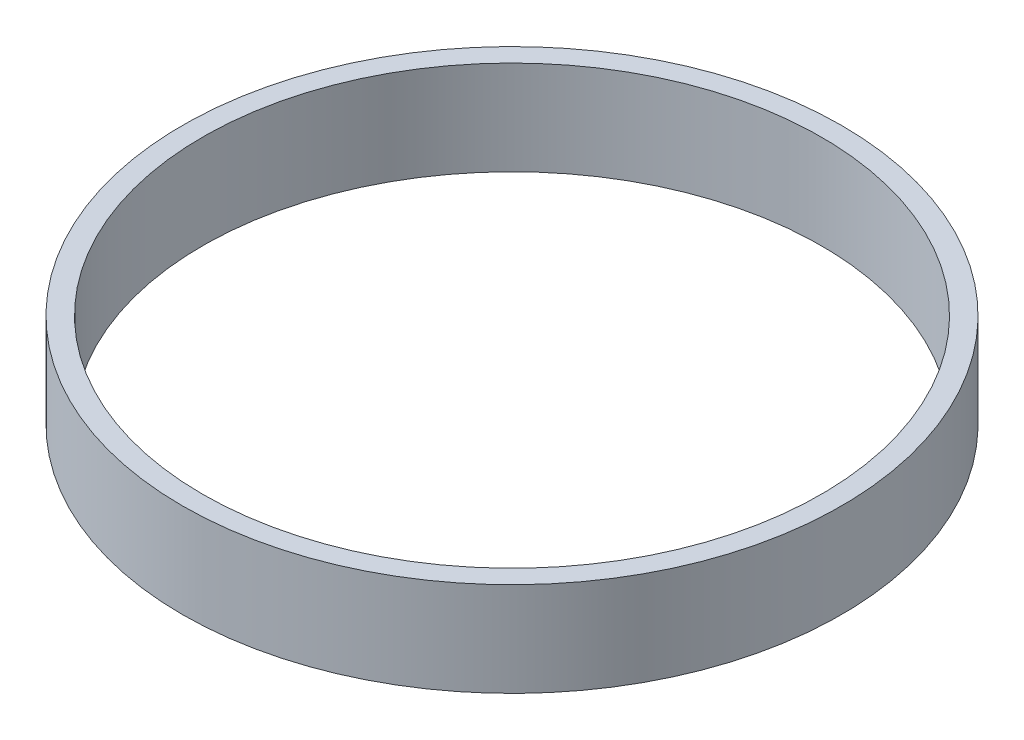
ISO-10303-21;
HEADER;
FILE_DESCRIPTION(('STEP AP214'),'2;1');
FILE_NAME('part.step','',(''),(''),'','','');
FILE_SCHEMA(('AUTOMOTIVE_DESIGN { 1 0 10303 214 1 1 1 1 }'));
ENDSEC;
DATA;
#1=APPLICATION_CONTEXT('core data for automotive mechanical design processes');
#2=APPLICATION_PROTOCOL_DEFINITION('international standard','automotive_design',2000,#1);
#3=PRODUCT_CONTEXT('',#1,'mechanical');
#4=PRODUCT('Part','Part','',(#3));
#5=PRODUCT_RELATED_PRODUCT_CATEGORY('part','',(#4));
#6=PRODUCT_DEFINITION_FORMATION('','',#4);
#7=PRODUCT_DEFINITION_CONTEXT('part definition',#1,'design');
#8=PRODUCT_DEFINITION('design','',#6,#7);
#9=PRODUCT_DEFINITION_SHAPE('','',#8);
#10=(LENGTH_UNIT() NAMED_UNIT(*) SI_UNIT(.MILLI.,.METRE.));
#11=(NAMED_UNIT(*) PLANE_ANGLE_UNIT() SI_UNIT($,.RADIAN.));
#12=(NAMED_UNIT(*) SI_UNIT($,.STERADIAN.) SOLID_ANGLE_UNIT());
#13=UNCERTAINTY_MEASURE_WITH_UNIT(LENGTH_MEASURE(1.E-05),#10,'distance_accuracy_value','');
#14=(GEOMETRIC_REPRESENTATION_CONTEXT(3) GLOBAL_UNCERTAINTY_ASSIGNED_CONTEXT((#13)) GLOBAL_UNIT_ASSIGNED_CONTEXT((#10,
#11,#12)) REPRESENTATION_CONTEXT('',''));
#15=CARTESIAN_POINT('',(0.,0.,0.));
#16=DIRECTION('',(0.,0.,1.));
#17=DIRECTION('',(1.,0.,0.));
#18=AXIS2_PLACEMENT_3D('',#15,#16,#17);
#19=CARTESIAN_POINT('',(0.,7.,0.));
#20=DIRECTION('',(0.,1.,0.));
#21=DIRECTION('',(0.,0.,1.));
#22=AXIS2_PLACEMENT_3D('',#19,#20,#21);
#23=PLANE('',#22);
#24=CARTESIAN_POINT('',(0.,7.,0.));
#25=DIRECTION('',(0.,1.,0.));
#26=DIRECTION('',(0.,0.,1.));
#27=AXIS2_PLACEMENT_3D('',#24,#25,#26);
#28=CIRCLE('',#27,24.5);
#29=CARTESIAN_POINT('',(0.,7.,24.5));
#30=VERTEX_POINT('',#29);
#31=EDGE_CURVE('E10',#30,#30,#28,.T.);
#32=ORIENTED_EDGE('',*,*,#31,.T.);
#33=EDGE_LOOP('',(#32));
#34=FACE_BOUND('',#33,.T.);
#35=CARTESIAN_POINT('',(0.,7.,0.));
#36=DIRECTION('',(0.,1.,0.));
#37=DIRECTION('',(0.,0.,1.));
#38=AXIS2_PLACEMENT_3D('',#35,#36,#37);
#39=CIRCLE('',#38,23.);
#40=CARTESIAN_POINT('',(0.,7.,23.));
#41=VERTEX_POINT('',#40);
#42=EDGE_CURVE('E41',#41,#41,#39,.T.);
#43=ORIENTED_EDGE('',*,*,#42,.F.);
#44=EDGE_LOOP('',(#43));
#45=FACE_BOUND('',#44,.T.);
#46=ADVANCED_FACE('F30',(#34,#45),#23,.T.);
#47=CARTESIAN_POINT('',(0.,0.,0.));
#48=DIRECTION('',(0.,1.,0.));
#49=DIRECTION('',(0.,0.,1.));
#50=AXIS2_PLACEMENT_3D('',#47,#48,#49);
#51=PLANE('',#50);
#52=CARTESIAN_POINT('',(0.,0.,0.));
#53=DIRECTION('',(0.,1.,0.));
#54=DIRECTION('',(0.,0.,1.));
#55=AXIS2_PLACEMENT_3D('',#52,#53,#54);
#56=CIRCLE('',#55,24.5);
#57=CARTESIAN_POINT('',(0.,0.,24.5));
#58=VERTEX_POINT('',#57);
#59=EDGE_CURVE('E34',#58,#58,#56,.T.);
#60=ORIENTED_EDGE('',*,*,#59,.F.);
#61=EDGE_LOOP('',(#60));
#62=FACE_BOUND('',#61,.T.);
#63=CARTESIAN_POINT('',(0.,0.,0.));
#64=DIRECTION('',(0.,1.,0.));
#65=DIRECTION('',(0.,0.,1.));
#66=AXIS2_PLACEMENT_3D('',#63,#64,#65);
#67=CIRCLE('',#66,23.);
#68=CARTESIAN_POINT('',(0.,0.,23.));
#69=VERTEX_POINT('',#68);
#70=EDGE_CURVE('E43',#69,#69,#67,.T.);
#71=ORIENTED_EDGE('',*,*,#70,.T.);
#72=EDGE_LOOP('',(#71));
#73=FACE_BOUND('',#72,.T.);
#74=ADVANCED_FACE('F53',(#62,#73),#51,.F.);
#75=CARTESIAN_POINT('',(0.,7.,0.));
#76=DIRECTION('',(0.,-1.,0.));
#77=DIRECTION('',(0.,0.,-1.));
#78=AXIS2_PLACEMENT_3D('',#75,#76,#77);
#79=CYLINDRICAL_SURFACE('',#78,24.5);
#80=ORIENTED_EDGE('',*,*,#31,.F.);
#81=EDGE_LOOP('',(#80));
#82=FACE_BOUND('',#81,.T.);
#83=ORIENTED_EDGE('',*,*,#59,.T.);
#84=EDGE_LOOP('',(#83));
#85=FACE_BOUND('',#84,.T.);
#86=ADVANCED_FACE('F32',(#82,#85),#79,.T.);
#87=CARTESIAN_POINT('',(0.,7.,0.));
#88=DIRECTION('',(0.,-1.,0.));
#89=DIRECTION('',(0.,0.,-1.));
#90=AXIS2_PLACEMENT_3D('',#87,#88,#89);
#91=CYLINDRICAL_SURFACE('',#90,23.);
#92=ORIENTED_EDGE('',*,*,#42,.T.);
#93=EDGE_LOOP('',(#92));
#94=FACE_BOUND('',#93,.T.);
#95=ORIENTED_EDGE('',*,*,#70,.F.);
#96=EDGE_LOOP('',(#95));
#97=FACE_BOUND('',#96,.T.);
#98=ADVANCED_FACE('F49',(#94,#97),#91,.F.);
#99=CLOSED_SHELL('',(#46,#74,#86,#98));
#100=MANIFOLD_SOLID_BREP('B2',#99);
#101=ADVANCED_BREP_SHAPE_REPRESENTATION('',(#18,#100),#14);
#102=SHAPE_DEFINITION_REPRESENTATION(#9,#101);
ENDSEC;
END-ISO-10303-21;
